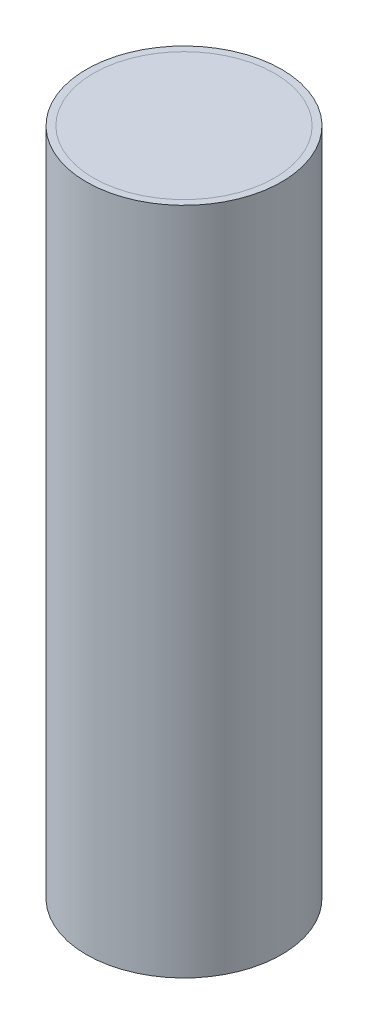
ISO-10303-21;
HEADER;
FILE_DESCRIPTION(('STEP AP214'),'2;1');
FILE_NAME('part.step','',(''),(''),'','','');
FILE_SCHEMA(('AUTOMOTIVE_DESIGN { 1 0 10303 214 1 1 1 1 }'));
ENDSEC;
DATA;
#1=APPLICATION_CONTEXT('core data for automotive mechanical design processes');
#2=APPLICATION_PROTOCOL_DEFINITION('international standard','automotive_design',2000,#1);
#3=PRODUCT_CONTEXT('',#1,'mechanical');
#4=PRODUCT('Part','Part','',(#3));
#5=PRODUCT_RELATED_PRODUCT_CATEGORY('part','',(#4));
#6=PRODUCT_DEFINITION_FORMATION('','',#4);
#7=PRODUCT_DEFINITION_CONTEXT('part definition',#1,'design');
#8=PRODUCT_DEFINITION('design','',#6,#7);
#9=PRODUCT_DEFINITION_SHAPE('','',#8);
#10=(LENGTH_UNIT() NAMED_UNIT(*) SI_UNIT(.MILLI.,.METRE.));
#11=(NAMED_UNIT(*) PLANE_ANGLE_UNIT() SI_UNIT($,.RADIAN.));
#12=(NAMED_UNIT(*) SI_UNIT($,.STERADIAN.) SOLID_ANGLE_UNIT());
#13=UNCERTAINTY_MEASURE_WITH_UNIT(LENGTH_MEASURE(1.E-05),#10,'distance_accuracy_value','');
#14=(GEOMETRIC_REPRESENTATION_CONTEXT(3) GLOBAL_UNCERTAINTY_ASSIGNED_CONTEXT((#13)) GLOBAL_UNIT_ASSIGNED_CONTEXT((#10,
#11,#12)) REPRESENTATION_CONTEXT('',''));
#15=CARTESIAN_POINT('',(0.,0.,0.));
#16=DIRECTION('',(0.,0.,1.));
#17=DIRECTION('',(1.,0.,0.));
#18=AXIS2_PLACEMENT_3D('',#15,#16,#17);
#19=CARTESIAN_POINT('',(0.,304.8,0.));
#20=DIRECTION('',(0.,-1.,0.));
#21=DIRECTION('',(0.,0.,-1.));
#22=AXIS2_PLACEMENT_3D('',#19,#20,#21);
#23=CYLINDRICAL_SURFACE('',#22,41.275);
#24=CARTESIAN_POINT('',(0.,304.8,0.));
#25=DIRECTION('',(0.,1.,0.));
#26=DIRECTION('',(0.,0.,1.));
#27=AXIS2_PLACEMENT_3D('',#24,#25,#26);
#28=CIRCLE('',#27,41.275);
#29=CARTESIAN_POINT('',(0.,304.8,41.275));
#30=VERTEX_POINT('',#29);
#31=EDGE_CURVE('E11',#30,#30,#28,.T.);
#32=ORIENTED_EDGE('',*,*,#31,.F.);
#33=EDGE_LOOP('',(#32));
#34=FACE_BOUND('',#33,.T.);
#35=CARTESIAN_POINT('',(0.,0.,0.));
#36=DIRECTION('',(0.,1.,0.));
#37=DIRECTION('',(0.,0.,1.));
#38=AXIS2_PLACEMENT_3D('',#35,#36,#37);
#39=CIRCLE('',#38,41.275);
#40=CARTESIAN_POINT('',(0.,0.,41.275));
#41=VERTEX_POINT('',#40);
#42=EDGE_CURVE('E47',#41,#41,#39,.T.);
#43=ORIENTED_EDGE('',*,*,#42,.T.);
#44=EDGE_LOOP('',(#43));
#45=FACE_BOUND('',#44,.T.);
#46=ADVANCED_FACE('F44',(#34,#45),#23,.T.);
#47=CARTESIAN_POINT('',(-97.9314213562373,304.8,0.));
#48=DIRECTION('',(0.,1.,0.));
#49=DIRECTION('',(0.,0.,1.));
#50=AXIS2_PLACEMENT_3D('',#47,#48,#49);
#51=PLANE('',#50);
#52=ORIENTED_EDGE('',*,*,#31,.T.);
#53=EDGE_LOOP('',(#52));
#54=FACE_BOUND('',#53,.T.);
#55=ADVANCED_FACE('F59',(#54),#51,.T.);
#56=CARTESIAN_POINT('',(-97.9314213562373,0.,0.));
#57=DIRECTION('',(0.,1.,0.));
#58=DIRECTION('',(0.,0.,1.));
#59=AXIS2_PLACEMENT_3D('',#56,#57,#58);
#60=PLANE('',#59);
#61=ORIENTED_EDGE('',*,*,#42,.F.);
#62=EDGE_LOOP('',(#61));
#63=FACE_BOUND('',#62,.T.);
#64=ADVANCED_FACE('F57',(#63),#60,.F.);
#65=CLOSED_SHELL('',(#46,#55,#64));
#66=MANIFOLD_SOLID_BREP('B2',#65);
#67=CARTESIAN_POINT('',(0.,304.8,0.));
#68=DIRECTION('',(0.,1.,0.));
#69=DIRECTION('',(0.,0.,1.));
#70=AXIS2_PLACEMENT_3D('',#67,#68,#69);
#71=PLANE('',#70);
#72=CARTESIAN_POINT('',(0.,304.8,0.));
#73=DIRECTION('',(0.,1.,0.));
#74=DIRECTION('',(0.,0.,1.));
#75=AXIS2_PLACEMENT_3D('',#72,#73,#74);
#76=CIRCLE('',#75,44.45);
#77=CARTESIAN_POINT('',(0.,304.8,44.45));
#78=VERTEX_POINT('',#77);
#79=EDGE_CURVE('E43',#78,#78,#76,.T.);
#80=ORIENTED_EDGE('',*,*,#79,.T.);
#81=EDGE_LOOP('',(#80));
#82=FACE_BOUND('',#81,.T.);
#83=CARTESIAN_POINT('',(0.,304.8,0.));
#84=DIRECTION('',(0.,1.,0.));
#85=DIRECTION('',(0.,0.,1.));
#86=AXIS2_PLACEMENT_3D('',#83,#84,#85);
#87=CIRCLE('',#86,41.275);
#88=CARTESIAN_POINT('',(0.,304.8,41.275));
#89=VERTEX_POINT('',#88);
#90=EDGE_CURVE('E95',#89,#89,#87,.T.);
#91=ORIENTED_EDGE('',*,*,#90,.F.);
#92=EDGE_LOOP('',(#91));
#93=FACE_BOUND('',#92,.T.);
#94=ADVANCED_FACE('F84',(#82,#93),#71,.T.);
#95=CARTESIAN_POINT('',(0.,0.,0.));
#96=DIRECTION('',(0.,1.,0.));
#97=DIRECTION('',(0.,0.,1.));
#98=AXIS2_PLACEMENT_3D('',#95,#96,#97);
#99=PLANE('',#98);
#100=CARTESIAN_POINT('',(0.,0.,0.));
#101=DIRECTION('',(0.,1.,0.));
#102=DIRECTION('',(0.,0.,1.));
#103=AXIS2_PLACEMENT_3D('',#100,#101,#102);
#104=CIRCLE('',#103,44.45);
#105=CARTESIAN_POINT('',(0.,0.,44.45));
#106=VERTEX_POINT('',#105);
#107=EDGE_CURVE('E88',#106,#106,#104,.T.);
#108=ORIENTED_EDGE('',*,*,#107,.F.);
#109=EDGE_LOOP('',(#108));
#110=FACE_BOUND('',#109,.T.);
#111=CARTESIAN_POINT('',(0.,0.,0.));
#112=DIRECTION('',(0.,1.,0.));
#113=DIRECTION('',(0.,0.,1.));
#114=AXIS2_PLACEMENT_3D('',#111,#112,#113);
#115=CIRCLE('',#114,41.275);
#116=CARTESIAN_POINT('',(0.,0.,41.275));
#117=VERTEX_POINT('',#116);
#118=EDGE_CURVE('E97',#117,#117,#115,.T.);
#119=ORIENTED_EDGE('',*,*,#118,.T.);
#120=EDGE_LOOP('',(#119));
#121=FACE_BOUND('',#120,.T.);
#122=ADVANCED_FACE('F107',(#110,#121),#99,.F.);
#123=CARTESIAN_POINT('',(0.,304.8,0.));
#124=DIRECTION('',(0.,-1.,0.));
#125=DIRECTION('',(0.,0.,-1.));
#126=AXIS2_PLACEMENT_3D('',#123,#124,#125);
#127=CYLINDRICAL_SURFACE('',#126,44.45);
#128=ORIENTED_EDGE('',*,*,#79,.F.);
#129=EDGE_LOOP('',(#128));
#130=FACE_BOUND('',#129,.T.);
#131=ORIENTED_EDGE('',*,*,#107,.T.);
#132=EDGE_LOOP('',(#131));
#133=FACE_BOUND('',#132,.T.);
#134=ADVANCED_FACE('F86',(#130,#133),#127,.T.);
#135=CARTESIAN_POINT('',(0.,304.8,0.));
#136=DIRECTION('',(0.,-1.,0.));
#137=DIRECTION('',(0.,0.,-1.));
#138=AXIS2_PLACEMENT_3D('',#135,#136,#137);
#139=CYLINDRICAL_SURFACE('',#138,41.275);
#140=ORIENTED_EDGE('',*,*,#90,.T.);
#141=EDGE_LOOP('',(#140));
#142=FACE_BOUND('',#141,.T.);
#143=ORIENTED_EDGE('',*,*,#118,.F.);
#144=EDGE_LOOP('',(#143));
#145=FACE_BOUND('',#144,.T.);
#146=ADVANCED_FACE('F103',(#142,#145),#139,.F.);
#147=CLOSED_SHELL('',(#94,#122,#134,#146));
#148=MANIFOLD_SOLID_BREP('B6',#147);
#149=ADVANCED_BREP_SHAPE_REPRESENTATION('',(#18,#66,#148),#14);
#150=SHAPE_DEFINITION_REPRESENTATION(#9,#149);
ENDSEC;
END-ISO-10303-21;
